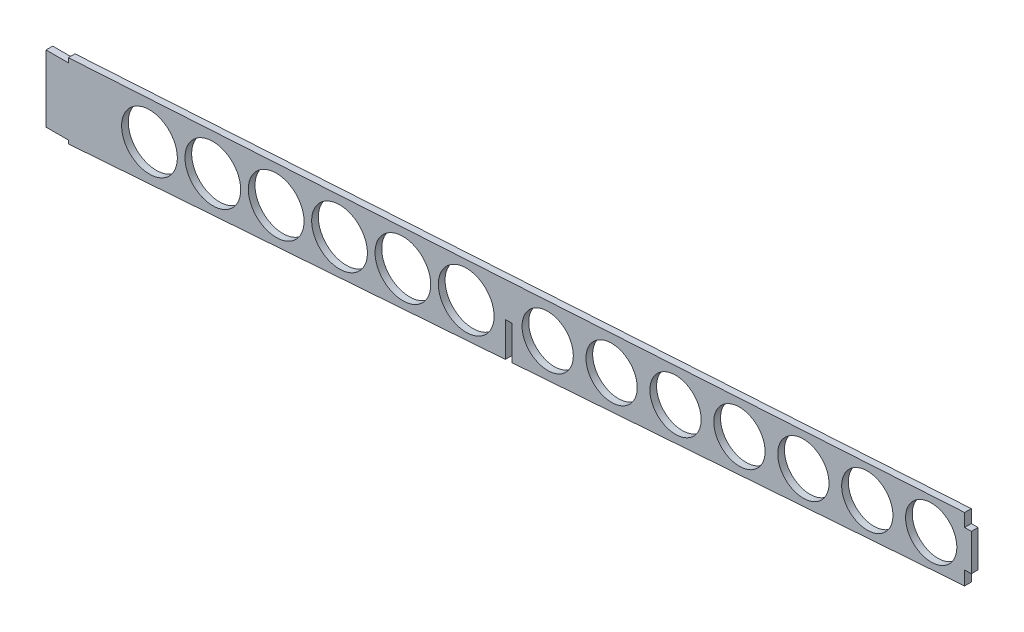
ISO-10303-21;
HEADER;
FILE_DESCRIPTION(('STEP AP214'),'2;1');
FILE_NAME('part.step','',(''),(''),'','','');
FILE_SCHEMA(('AUTOMOTIVE_DESIGN { 1 0 10303 214 1 1 1 1 }'));
ENDSEC;
DATA;
#1=APPLICATION_CONTEXT('core data for automotive mechanical design processes');
#2=APPLICATION_PROTOCOL_DEFINITION('international standard','automotive_design',2000,#1);
#3=PRODUCT_CONTEXT('',#1,'mechanical');
#4=PRODUCT('Part','Part','',(#3));
#5=PRODUCT_RELATED_PRODUCT_CATEGORY('part','',(#4));
#6=PRODUCT_DEFINITION_FORMATION('','',#4);
#7=PRODUCT_DEFINITION_CONTEXT('part definition',#1,'design');
#8=PRODUCT_DEFINITION('design','',#6,#7);
#9=PRODUCT_DEFINITION_SHAPE('','',#8);
#10=(LENGTH_UNIT() NAMED_UNIT(*) SI_UNIT(.MILLI.,.METRE.));
#11=(NAMED_UNIT(*) PLANE_ANGLE_UNIT() SI_UNIT($,.RADIAN.));
#12=(NAMED_UNIT(*) SI_UNIT($,.STERADIAN.) SOLID_ANGLE_UNIT());
#13=UNCERTAINTY_MEASURE_WITH_UNIT(LENGTH_MEASURE(1.E-05),#10,'distance_accuracy_value','');
#14=(GEOMETRIC_REPRESENTATION_CONTEXT(3) GLOBAL_UNCERTAINTY_ASSIGNED_CONTEXT((#13)) GLOBAL_UNIT_ASSIGNED_CONTEXT((#10,
#11,#12)) REPRESENTATION_CONTEXT('',''));
#15=CARTESIAN_POINT('',(0.,0.,0.));
#16=DIRECTION('',(0.,0.,1.));
#17=DIRECTION('',(1.,0.,0.));
#18=AXIS2_PLACEMENT_3D('',#15,#16,#17);
#19=CARTESIAN_POINT('',(-405.,0.,3.));
#20=DIRECTION('',(-0.0726951215049418,0.997354209551141,0.));
#21=DIRECTION('',(-0.997354209551141,-0.0726951215049418,0.));
#22=AXIS2_PLACEMENT_3D('',#19,#20,#21);
#23=PLANE('',#22);
#24=DIRECTION('',(0.997354209551141,0.0726951215049418,0.));
#25=VECTOR('',#24,1.);
#26=CARTESIAN_POINT('',(-405.,0.,0.));
#27=LINE('',#26,#25);
#28=CARTESIAN_POINT('',(-206.,14.5047055909996,0.));
#29=VERTEX_POINT('',#28);
#30=CARTESIAN_POINT('',(-3.,29.3009630531751,0.));
#31=VERTEX_POINT('',#30);
#32=EDGE_CURVE('E314',#29,#31,#27,.T.);
#33=ORIENTED_EDGE('',*,*,#32,.T.);
#34=DIRECTION('',(0.,0.,1.));
#35=VECTOR('',#34,1.);
#36=CARTESIAN_POINT('',(-3.,29.3009630531751,3.));
#37=LINE('',#36,#35);
#38=CARTESIAN_POINT('',(-3.,29.3009630531751,3.));
#39=VERTEX_POINT('',#38);
#40=EDGE_CURVE('E172',#31,#39,#37,.T.);
#41=ORIENTED_EDGE('',*,*,#40,.T.);
#42=DIRECTION('',(0.997354209551141,0.0726951215049418,0.));
#43=VECTOR('',#42,1.);
#44=CARTESIAN_POINT('',(-405.,0.,3.));
#45=LINE('',#44,#43);
#46=CARTESIAN_POINT('',(-206.,14.5047055909996,3.));
#47=VERTEX_POINT('',#46);
#48=EDGE_CURVE('E296',#47,#39,#45,.T.);
#49=ORIENTED_EDGE('',*,*,#48,.F.);
#50=DIRECTION('',(0.,0.,-1.));
#51=VECTOR('',#50,1.);
#52=CARTESIAN_POINT('',(-206.,14.5047055909996,3.));
#53=LINE('',#52,#51);
#54=EDGE_CURVE('E243',#47,#29,#53,.T.);
#55=ORIENTED_EDGE('',*,*,#54,.T.);
#56=EDGE_LOOP('',(#33,#41,#49,#55));
#57=FACE_BOUND('',#56,.T.);
#58=ADVANCED_FACE('F37',(#57),#23,.F.);
#59=CARTESIAN_POINT('',(-415.,31.5,3.));
#60=DIRECTION('',(0.,-1.,0.));
#61=DIRECTION('',(0.,0.,-1.));
#62=AXIS2_PLACEMENT_3D('',#59,#60,#61);
#63=PLANE('',#62);
#64=DIRECTION('',(-1.,0.,0.));
#65=VECTOR('',#64,1.);
#66=CARTESIAN_POINT('',(-415.,31.5,0.));
#67=LINE('',#66,#65);
#68=CARTESIAN_POINT('',(-405.,31.5,0.));
#69=VERTEX_POINT('',#68);
#70=CARTESIAN_POINT('',(-415.,31.5,0.));
#71=VERTEX_POINT('',#70);
#72=EDGE_CURVE('E285',#69,#71,#67,.T.);
#73=ORIENTED_EDGE('',*,*,#72,.T.);
#74=DIRECTION('',(0.,0.,-1.));
#75=VECTOR('',#74,1.);
#76=CARTESIAN_POINT('',(-415.,31.5,3.));
#77=LINE('',#76,#75);
#78=CARTESIAN_POINT('',(-415.,31.5,3.));
#79=VERTEX_POINT('',#78);
#80=EDGE_CURVE('E338',#79,#71,#77,.T.);
#81=ORIENTED_EDGE('',*,*,#80,.F.);
#82=DIRECTION('',(-1.,0.,0.));
#83=VECTOR('',#82,1.);
#84=CARTESIAN_POINT('',(-415.,31.5,3.));
#85=LINE('',#84,#83);
#86=CARTESIAN_POINT('',(-405.,31.5,3.));
#87=VERTEX_POINT('',#86);
#88=EDGE_CURVE('E286',#87,#79,#85,.T.);
#89=ORIENTED_EDGE('',*,*,#88,.F.);
#90=DIRECTION('',(0.,0.,-1.));
#91=VECTOR('',#90,1.);
#92=CARTESIAN_POINT('',(-405.,31.5,3.));
#93=LINE('',#92,#91);
#94=EDGE_CURVE('E305',#87,#69,#93,.T.);
#95=ORIENTED_EDGE('',*,*,#94,.T.);
#96=EDGE_LOOP('',(#73,#81,#89,#95));
#97=FACE_BOUND('',#96,.T.);
#98=ADVANCED_FACE('F39',(#97),#63,.F.);
#99=CARTESIAN_POINT('',(-415.,1.5,3.));
#100=DIRECTION('',(1.,0.,0.));
#101=DIRECTION('',(0.,0.,-1.));
#102=AXIS2_PLACEMENT_3D('',#99,#100,#101);
#103=PLANE('',#102);
#104=DIRECTION('',(0.,-1.,0.));
#105=VECTOR('',#104,1.);
#106=CARTESIAN_POINT('',(-415.,1.5,0.));
#107=LINE('',#106,#105);
#108=CARTESIAN_POINT('',(-415.,1.5,0.));
#109=VERTEX_POINT('',#108);
#110=EDGE_CURVE('E308',#71,#109,#107,.T.);
#111=ORIENTED_EDGE('',*,*,#110,.T.);
#112=DIRECTION('',(0.,0.,-1.));
#113=VECTOR('',#112,1.);
#114=CARTESIAN_POINT('',(-415.,1.5,3.));
#115=LINE('',#114,#113);
#116=CARTESIAN_POINT('',(-415.,1.5,3.));
#117=VERTEX_POINT('',#116);
#118=EDGE_CURVE('E335',#117,#109,#115,.T.);
#119=ORIENTED_EDGE('',*,*,#118,.F.);
#120=DIRECTION('',(0.,-1.,0.));
#121=VECTOR('',#120,1.);
#122=CARTESIAN_POINT('',(-415.,1.5,3.));
#123=LINE('',#122,#121);
#124=EDGE_CURVE('E289',#79,#117,#123,.T.);
#125=ORIENTED_EDGE('',*,*,#124,.F.);
#126=ORIENTED_EDGE('',*,*,#80,.T.);
#127=EDGE_LOOP('',(#111,#119,#125,#126));
#128=FACE_BOUND('',#127,.T.);
#129=ADVANCED_FACE('F366',(#128),#103,.F.);
#130=CARTESIAN_POINT('',(-415.,1.5,3.));
#131=DIRECTION('',(0.,1.,0.));
#132=DIRECTION('',(0.,0.,1.));
#133=AXIS2_PLACEMENT_3D('',#130,#131,#132);
#134=PLANE('',#133);
#135=DIRECTION('',(1.,0.,0.));
#136=VECTOR('',#135,1.);
#137=CARTESIAN_POINT('',(-415.,1.5,0.));
#138=LINE('',#137,#136);
#139=CARTESIAN_POINT('',(-405.,1.5,0.));
#140=VERTEX_POINT('',#139);
#141=EDGE_CURVE('E310',#109,#140,#138,.T.);
#142=ORIENTED_EDGE('',*,*,#141,.T.);
#143=DIRECTION('',(0.,0.,-1.));
#144=VECTOR('',#143,1.);
#145=CARTESIAN_POINT('',(-405.,1.5,3.));
#146=LINE('',#145,#144);
#147=CARTESIAN_POINT('',(-405.,1.5,3.));
#148=VERTEX_POINT('',#147);
#149=EDGE_CURVE('E332',#148,#140,#146,.T.);
#150=ORIENTED_EDGE('',*,*,#149,.F.);
#151=DIRECTION('',(1.,0.,0.));
#152=VECTOR('',#151,1.);
#153=CARTESIAN_POINT('',(-415.,1.5,3.));
#154=LINE('',#153,#152);
#155=EDGE_CURVE('E292',#117,#148,#154,.T.);
#156=ORIENTED_EDGE('',*,*,#155,.F.);
#157=ORIENTED_EDGE('',*,*,#118,.T.);
#158=EDGE_LOOP('',(#142,#150,#156,#157));
#159=FACE_BOUND('',#158,.T.);
#160=ADVANCED_FACE('F373',(#159),#134,.F.);
#161=CARTESIAN_POINT('',(-405.,1.5,3.));
#162=DIRECTION('',(1.,0.,0.));
#163=DIRECTION('',(0.,0.,-1.));
#164=AXIS2_PLACEMENT_3D('',#161,#162,#163);
#165=PLANE('',#164);
#166=DIRECTION('',(0.,-1.,0.));
#167=VECTOR('',#166,1.);
#168=CARTESIAN_POINT('',(-405.,1.5,0.));
#169=LINE('',#168,#167);
#170=CARTESIAN_POINT('',(-405.,0.,0.));
#171=VERTEX_POINT('',#170);
#172=EDGE_CURVE('E312',#140,#171,#169,.T.);
#173=ORIENTED_EDGE('',*,*,#172,.T.);
#174=DIRECTION('',(0.,0.,-1.));
#175=VECTOR('',#174,1.);
#176=CARTESIAN_POINT('',(-405.,0.,3.));
#177=LINE('',#176,#175);
#178=CARTESIAN_POINT('',(-405.,0.,3.));
#179=VERTEX_POINT('',#178);
#180=EDGE_CURVE('E329',#179,#171,#177,.T.);
#181=ORIENTED_EDGE('',*,*,#180,.F.);
#182=DIRECTION('',(0.,-1.,0.));
#183=VECTOR('',#182,1.);
#184=CARTESIAN_POINT('',(-405.,1.5,3.));
#185=LINE('',#184,#183);
#186=EDGE_CURVE('E294',#148,#179,#185,.T.);
#187=ORIENTED_EDGE('',*,*,#186,.F.);
#188=ORIENTED_EDGE('',*,*,#149,.T.);
#189=EDGE_LOOP('',(#173,#181,#187,#188));
#190=FACE_BOUND('',#189,.T.);
#191=ADVANCED_FACE('F377',(#190),#165,.F.);
#192=CARTESIAN_POINT('',(-209.,14.2860416876177,0.));
#193=VERTEX_POINT('',#192);
#194=EDGE_CURVE('E315',#171,#193,#27,.T.);
#195=ORIENTED_EDGE('',*,*,#194,.T.);
#196=DIRECTION('',(0.,0.,1.));
#197=VECTOR('',#196,1.);
#198=CARTESIAN_POINT('',(-209.,14.2860416876177,0.));
#199=LINE('',#198,#197);
#200=CARTESIAN_POINT('',(-209.,14.2860416876177,3.));
#201=VERTEX_POINT('',#200);
#202=EDGE_CURVE('E229',#193,#201,#199,.T.);
#203=ORIENTED_EDGE('',*,*,#202,.T.);
#204=EDGE_CURVE('E297',#179,#201,#45,.T.);
#205=ORIENTED_EDGE('',*,*,#204,.F.);
#206=ORIENTED_EDGE('',*,*,#180,.T.);
#207=EDGE_LOOP('',(#195,#203,#205,#206));
#208=FACE_BOUND('',#207,.T.);
#209=ADVANCED_FACE('F381',(#208),#23,.F.);
#210=CARTESIAN_POINT('',(0.,58.019626956557,3.));
#211=DIRECTION('',(-1.,0.,0.));
#212=DIRECTION('',(0.,-1.,0.));
#213=AXIS2_PLACEMENT_3D('',#210,#211,#212);
#214=PLANE('',#213);
#215=DIRECTION('',(0.,1.,0.));
#216=VECTOR('',#215,1.);
#217=CARTESIAN_POINT('',(0.,58.019626956557,0.));
#218=LINE('',#217,#216);
#219=CARTESIAN_POINT('',(0.,35.519626956557,0.));
#220=VERTEX_POINT('',#219);
#221=CARTESIAN_POINT('',(0.,52.019626956557,0.));
#222=VERTEX_POINT('',#221);
#223=EDGE_CURVE('E318',#220,#222,#218,.T.);
#224=ORIENTED_EDGE('',*,*,#223,.T.);
#225=DIRECTION('',(0.,0.,1.));
#226=VECTOR('',#225,1.);
#227=CARTESIAN_POINT('',(0.,52.019626956557,-7.));
#228=LINE('',#227,#226);
#229=CARTESIAN_POINT('',(0.,52.019626956557,3.));
#230=VERTEX_POINT('',#229);
#231=EDGE_CURVE('E153',#222,#230,#228,.T.);
#232=ORIENTED_EDGE('',*,*,#231,.T.);
#233=DIRECTION('',(0.,1.,0.));
#234=VECTOR('',#233,1.);
#235=CARTESIAN_POINT('',(0.,58.019626956557,3.));
#236=LINE('',#235,#234);
#237=CARTESIAN_POINT('',(0.,35.519626956557,3.));
#238=VERTEX_POINT('',#237);
#239=EDGE_CURVE('E169',#238,#230,#236,.T.);
#240=ORIENTED_EDGE('',*,*,#239,.F.);
#241=DIRECTION('',(0.,0.,1.));
#242=VECTOR('',#241,1.);
#243=CARTESIAN_POINT('',(0.,35.519626956557,-7.));
#244=LINE('',#243,#242);
#245=EDGE_CURVE('E174',#220,#238,#244,.T.);
#246=ORIENTED_EDGE('',*,*,#245,.F.);
#247=EDGE_LOOP('',(#224,#232,#240,#246));
#248=FACE_BOUND('',#247,.T.);
#249=ADVANCED_FACE('F404',(#248),#214,.F.);
#250=CARTESIAN_POINT('',(-405.,33.5,3.));
#251=DIRECTION('',(0.0604316379648142,-0.99817233839297,0.));
#252=DIRECTION('',(0.99817233839297,0.0604316379648142,0.));
#253=AXIS2_PLACEMENT_3D('',#250,#251,#252);
#254=PLANE('',#253);
#255=DIRECTION('',(-0.99817233839297,-0.0604316379648142,0.));
#256=VECTOR('',#255,1.);
#257=CARTESIAN_POINT('',(-405.,33.5,3.));
#258=LINE('',#257,#256);
#259=CARTESIAN_POINT('',(-3.,57.8380000902121,3.));
#260=VERTEX_POINT('',#259);
#261=CARTESIAN_POINT('',(-405.,33.5,3.));
#262=VERTEX_POINT('',#261);
#263=EDGE_CURVE('E301',#260,#262,#258,.T.);
#264=ORIENTED_EDGE('',*,*,#263,.F.);
#265=DIRECTION('',(0.,0.,-1.));
#266=VECTOR('',#265,1.);
#267=CARTESIAN_POINT('',(-3.,57.8380000902121,3.));
#268=LINE('',#267,#266);
#269=CARTESIAN_POINT('',(-3.00000000000003,57.8380000902121,0.));
#270=VERTEX_POINT('',#269);
#271=EDGE_CURVE('E159',#260,#270,#268,.T.);
#272=ORIENTED_EDGE('',*,*,#271,.T.);
#273=DIRECTION('',(-0.99817233839297,-0.0604316379648142,0.));
#274=VECTOR('',#273,1.);
#275=CARTESIAN_POINT('',(-405.,33.5,0.));
#276=LINE('',#275,#274);
#277=CARTESIAN_POINT('',(-405.,33.5,0.));
#278=VERTEX_POINT('',#277);
#279=EDGE_CURVE('E321',#270,#278,#276,.T.);
#280=ORIENTED_EDGE('',*,*,#279,.T.);
#281=DIRECTION('',(0.,0.,-1.));
#282=VECTOR('',#281,1.);
#283=CARTESIAN_POINT('',(-405.,33.5,3.));
#284=LINE('',#283,#282);
#285=EDGE_CURVE('E326',#262,#278,#284,.T.);
#286=ORIENTED_EDGE('',*,*,#285,.F.);
#287=EDGE_LOOP('',(#264,#272,#280,#286));
#288=FACE_BOUND('',#287,.T.);
#289=ADVANCED_FACE('F355',(#288),#254,.F.);
#290=CARTESIAN_POINT('',(-405.,31.5,3.));
#291=DIRECTION('',(1.,0.,0.));
#292=DIRECTION('',(0.,0.,-1.));
#293=AXIS2_PLACEMENT_3D('',#290,#291,#292);
#294=PLANE('',#293);
#295=DIRECTION('',(0.,-1.,0.));
#296=VECTOR('',#295,1.);
#297=CARTESIAN_POINT('',(-405.,31.5,0.));
#298=LINE('',#297,#296);
#299=EDGE_CURVE('E290',#278,#69,#298,.T.);
#300=ORIENTED_EDGE('',*,*,#299,.T.);
#301=ORIENTED_EDGE('',*,*,#94,.F.);
#302=DIRECTION('',(0.,-1.,0.));
#303=VECTOR('',#302,1.);
#304=CARTESIAN_POINT('',(-405.,31.5,3.));
#305=LINE('',#304,#303);
#306=EDGE_CURVE('E303',#262,#87,#305,.T.);
#307=ORIENTED_EDGE('',*,*,#306,.F.);
#308=ORIENTED_EDGE('',*,*,#285,.T.);
#309=EDGE_LOOP('',(#300,#301,#307,#308));
#310=FACE_BOUND('',#309,.T.);
#311=ADVANCED_FACE('F362',(#310),#294,.F.);
#312=CARTESIAN_POINT('',(0.,0.,3.));
#313=DIRECTION('',(0.,0.,1.));
#314=DIRECTION('',(1.,0.,0.));
#315=AXIS2_PLACEMENT_3D('',#312,#313,#314);
#316=PLANE('',#315);
#317=DIRECTION('',(1.,0.,0.));
#318=VECTOR('',#317,1.);
#319=CARTESIAN_POINT('',(0.,52.019626956557,3.));
#320=LINE('',#319,#318);
#321=CARTESIAN_POINT('',(-3.,52.019626956557,3.));
#322=VERTEX_POINT('',#321);
#323=EDGE_CURVE('E150',#322,#230,#320,.T.);
#324=ORIENTED_EDGE('',*,*,#323,.F.);
#325=DIRECTION('',(0.,-1.,0.));
#326=VECTOR('',#325,1.);
#327=CARTESIAN_POINT('',(-3.,58.019626956557,3.));
#328=LINE('',#327,#326);
#329=EDGE_CURVE('E156',#260,#322,#328,.T.);
#330=ORIENTED_EDGE('',*,*,#329,.F.);
#331=ORIENTED_EDGE('',*,*,#263,.T.);
#332=ORIENTED_EDGE('',*,*,#306,.T.);
#333=ORIENTED_EDGE('',*,*,#88,.T.);
#334=ORIENTED_EDGE('',*,*,#124,.T.);
#335=ORIENTED_EDGE('',*,*,#155,.T.);
#336=ORIENTED_EDGE('',*,*,#186,.T.);
#337=ORIENTED_EDGE('',*,*,#204,.T.);
#338=DIRECTION('',(0.,-1.,0.));
#339=VECTOR('',#338,1.);
#340=CARTESIAN_POINT('',(-209.,0.,3.));
#341=LINE('',#340,#339);
#342=CARTESIAN_POINT('',(-209.,29.805119766676,3.));
#343=VERTEX_POINT('',#342);
#344=EDGE_CURVE('E239',#343,#201,#341,.T.);
#345=ORIENTED_EDGE('',*,*,#344,.F.);
#346=DIRECTION('',(-1.,0.,0.));
#347=VECTOR('',#346,1.);
#348=CARTESIAN_POINT('',(0.,29.805119766676,3.));
#349=LINE('',#348,#347);
#350=CARTESIAN_POINT('',(-206.,29.805119766676,3.));
#351=VERTEX_POINT('',#350);
#352=EDGE_CURVE('E232',#351,#343,#349,.T.);
#353=ORIENTED_EDGE('',*,*,#352,.F.);
#354=DIRECTION('',(0.,1.,0.));
#355=VECTOR('',#354,1.);
#356=CARTESIAN_POINT('',(-206.,0.,3.));
#357=LINE('',#356,#355);
#358=EDGE_CURVE('E241',#47,#351,#357,.T.);
#359=ORIENTED_EDGE('',*,*,#358,.F.);
#360=ORIENTED_EDGE('',*,*,#48,.T.);
#361=DIRECTION('',(0.,-1.,0.));
#362=VECTOR('',#361,1.);
#363=CARTESIAN_POINT('',(-3.,28.1899742356754,3.));
#364=LINE('',#363,#362);
#365=CARTESIAN_POINT('',(-3.,35.519626956557,3.));
#366=VERTEX_POINT('',#365);
#367=EDGE_CURVE('E176',#366,#39,#364,.T.);
#368=ORIENTED_EDGE('',*,*,#367,.F.);
#369=DIRECTION('',(-1.,0.,0.));
#370=VECTOR('',#369,1.);
#371=CARTESIAN_POINT('',(0.,35.519626956557,3.));
#372=LINE('',#371,#370);
#373=EDGE_CURVE('E162',#238,#366,#372,.T.);
#374=ORIENTED_EDGE('',*,*,#373,.F.);
#375=ORIENTED_EDGE('',*,*,#239,.T.);
#376=EDGE_LOOP('',(#324,#330,#331,#332,#333,#334,#335,#336,#337,#345,#353,#359,#360,#368,#374,#375));
#377=FACE_BOUND('',#376,.T.);
#378=CARTESIAN_POINT('',(-17.9875508342229,42.5721366447861,3.));
#379=DIRECTION('',(0.,0.,1.));
#380=DIRECTION('',(1.,0.,0.));
#381=AXIS2_PLACEMENT_3D('',#378,#379,#380);
#382=CIRCLE('',#381,11.5);
#383=CARTESIAN_POINT('',(-6.4875508342229,42.5721366447861,3.));
#384=VERTEX_POINT('',#383);
#385=EDGE_CURVE('E282',#384,#384,#382,.T.);
#386=ORIENTED_EDGE('',*,*,#385,.F.);
#387=EDGE_LOOP('',(#386));
#388=FACE_BOUND('',#387,.T.);
#389=CARTESIAN_POINT('',(-46.6562923618524,40.6407896089128,3.));
#390=DIRECTION('',(0.,0.,1.));
#391=DIRECTION('',(1.,0.,0.));
#392=AXIS2_PLACEMENT_3D('',#389,#390,#391);
#393=CIRCLE('',#392,11.5);
#394=CARTESIAN_POINT('',(-35.1562923618524,40.6407896089128,3.));
#395=VERTEX_POINT('',#394);
#396=EDGE_CURVE('E279',#395,#395,#393,.T.);
#397=ORIENTED_EDGE('',*,*,#396,.F.);
#398=EDGE_LOOP('',(#397));
#399=FACE_BOUND('',#398,.T.);
#400=CARTESIAN_POINT('',(-75.3250338894819,38.7094425730394,3.));
#401=DIRECTION('',(0.,0.,1.));
#402=DIRECTION('',(1.,0.,0.));
#403=AXIS2_PLACEMENT_3D('',#400,#401,#402);
#404=CIRCLE('',#403,11.5);
#405=CARTESIAN_POINT('',(-63.8250338894819,38.7094425730394,3.));
#406=VERTEX_POINT('',#405);
#407=EDGE_CURVE('E276',#406,#406,#404,.T.);
#408=ORIENTED_EDGE('',*,*,#407,.F.);
#409=EDGE_LOOP('',(#408));
#410=FACE_BOUND('',#409,.T.);
#411=CARTESIAN_POINT('',(-103.993775417111,36.778095537166,3.));
#412=DIRECTION('',(0.,0.,1.));
#413=DIRECTION('',(1.,0.,0.));
#414=AXIS2_PLACEMENT_3D('',#411,#412,#413);
#415=CIRCLE('',#414,11.5);
#416=CARTESIAN_POINT('',(-92.4937754171115,36.778095537166,3.));
#417=VERTEX_POINT('',#416);
#418=EDGE_CURVE('E273',#417,#417,#415,.T.);
#419=ORIENTED_EDGE('',*,*,#418,.F.);
#420=EDGE_LOOP('',(#419));
#421=FACE_BOUND('',#420,.T.);
#422=CARTESIAN_POINT('',(-132.662516944741,34.8467485012927,3.));
#423=DIRECTION('',(0.,0.,1.));
#424=DIRECTION('',(1.,0.,0.));
#425=AXIS2_PLACEMENT_3D('',#422,#423,#424);
#426=CIRCLE('',#425,11.5);
#427=CARTESIAN_POINT('',(-121.162516944741,34.8467485012927,3.));
#428=VERTEX_POINT('',#427);
#429=EDGE_CURVE('E270',#428,#428,#426,.T.);
#430=ORIENTED_EDGE('',*,*,#429,.F.);
#431=EDGE_LOOP('',(#430));
#432=FACE_BOUND('',#431,.T.);
#433=CARTESIAN_POINT('',(-161.33125847237,32.9154014654193,3.));
#434=DIRECTION('',(0.,0.,1.));
#435=DIRECTION('',(1.,0.,0.));
#436=AXIS2_PLACEMENT_3D('',#433,#434,#435);
#437=CIRCLE('',#436,11.5);
#438=CARTESIAN_POINT('',(-149.83125847237,32.9154014654193,3.));
#439=VERTEX_POINT('',#438);
#440=EDGE_CURVE('E267',#439,#439,#437,.T.);
#441=ORIENTED_EDGE('',*,*,#440,.F.);
#442=EDGE_LOOP('',(#441));
#443=FACE_BOUND('',#442,.T.);
#444=CARTESIAN_POINT('',(-190.,30.984054429546,3.));
#445=DIRECTION('',(0.,0.,1.));
#446=DIRECTION('',(1.,0.,0.));
#447=AXIS2_PLACEMENT_3D('',#444,#445,#446);
#448=CIRCLE('',#447,11.5);
#449=CARTESIAN_POINT('',(-178.5,30.984054429546,3.));
#450=VERTEX_POINT('',#449);
#451=EDGE_CURVE('E264',#450,#450,#448,.T.);
#452=ORIENTED_EDGE('',*,*,#451,.F.);
#453=EDGE_LOOP('',(#452));
#454=FACE_BOUND('',#453,.T.);
#455=CARTESIAN_POINT('',(-226.526791626511,28.5233286711503,3.));
#456=DIRECTION('',(0.,0.,1.));
#457=DIRECTION('',(1.,0.,0.));
#458=AXIS2_PLACEMENT_3D('',#455,#456,#457);
#459=CIRCLE('',#458,12.5);
#460=CARTESIAN_POINT('',(-214.026791626511,28.5233286711503,3.));
#461=VERTEX_POINT('',#460);
#462=EDGE_CURVE('E261',#461,#461,#459,.T.);
#463=ORIENTED_EDGE('',*,*,#462,.F.);
#464=EDGE_LOOP('',(#463));
#465=FACE_BOUND('',#464,.T.);
#466=CARTESIAN_POINT('',(-254.938993022092,26.6092641526535,3.));
#467=DIRECTION('',(0.,0.,1.));
#468=DIRECTION('',(1.,0.,0.));
#469=AXIS2_PLACEMENT_3D('',#466,#467,#468);
#470=CIRCLE('',#469,12.5);
#471=CARTESIAN_POINT('',(-242.438993022092,26.6092641526535,3.));
#472=VERTEX_POINT('',#471);
#473=EDGE_CURVE('E258',#472,#472,#470,.T.);
#474=ORIENTED_EDGE('',*,*,#473,.F.);
#475=EDGE_LOOP('',(#474));
#476=FACE_BOUND('',#475,.T.);
#477=CARTESIAN_POINT('',(-283.351194417674,24.6951996341566,3.));
#478=DIRECTION('',(0.,0.,1.));
#479=DIRECTION('',(1.,0.,0.));
#480=AXIS2_PLACEMENT_3D('',#477,#478,#479);
#481=CIRCLE('',#480,12.5);
#482=CARTESIAN_POINT('',(-270.851194417674,24.6951996341566,3.));
#483=VERTEX_POINT('',#482);
#484=EDGE_CURVE('E255',#483,#483,#481,.T.);
#485=ORIENTED_EDGE('',*,*,#484,.F.);
#486=EDGE_LOOP('',(#485));
#487=FACE_BOUND('',#486,.T.);
#488=CARTESIAN_POINT('',(-311.763395813255,22.7811351156597,3.));
#489=DIRECTION('',(0.,0.,1.));
#490=DIRECTION('',(1.,0.,0.));
#491=AXIS2_PLACEMENT_3D('',#488,#489,#490);
#492=CIRCLE('',#491,12.5);
#493=CARTESIAN_POINT('',(-299.263395813255,22.7811351156597,3.));
#494=VERTEX_POINT('',#493);
#495=EDGE_CURVE('E252',#494,#494,#492,.T.);
#496=ORIENTED_EDGE('',*,*,#495,.F.);
#497=EDGE_LOOP('',(#496));
#498=FACE_BOUND('',#497,.T.);
#499=CARTESIAN_POINT('',(-340.175597208837,20.8670705971629,3.));
#500=DIRECTION('',(0.,0.,1.));
#501=DIRECTION('',(1.,0.,0.));
#502=AXIS2_PLACEMENT_3D('',#499,#500,#501);
#503=CIRCLE('',#502,12.5);
#504=CARTESIAN_POINT('',(-327.675597208837,20.8670705971629,3.));
#505=VERTEX_POINT('',#504);
#506=EDGE_CURVE('E249',#505,#505,#503,.T.);
#507=ORIENTED_EDGE('',*,*,#506,.F.);
#508=EDGE_LOOP('',(#507));
#509=FACE_BOUND('',#508,.T.);
#510=CARTESIAN_POINT('',(-368.587798604418,18.953006078666,3.));
#511=DIRECTION('',(0.,0.,1.));
#512=DIRECTION('',(1.,0.,0.));
#513=AXIS2_PLACEMENT_3D('',#510,#511,#512);
#514=CIRCLE('',#513,12.5);
#515=CARTESIAN_POINT('',(-356.087798604418,18.953006078666,3.));
#516=VERTEX_POINT('',#515);
#517=EDGE_CURVE('E246',#516,#516,#514,.T.);
#518=ORIENTED_EDGE('',*,*,#517,.F.);
#519=EDGE_LOOP('',(#518));
#520=FACE_BOUND('',#519,.T.);
#521=ADVANCED_FACE('F165',(#377,#388,#399,#410,#421,#432,#443,#454,#465,#476,#487,#498,#509,
#520),#316,.T.);
#522=CARTESIAN_POINT('',(0.,0.,0.));
#523=DIRECTION('',(0.,0.,1.));
#524=DIRECTION('',(1.,0.,0.));
#525=AXIS2_PLACEMENT_3D('',#522,#523,#524);
#526=PLANE('',#525);
#527=CARTESIAN_POINT('',(-17.9875508342229,42.5721366447861,0.));
#528=DIRECTION('',(0.,0.,1.));
#529=DIRECTION('',(1.,0.,0.));
#530=AXIS2_PLACEMENT_3D('',#527,#528,#529);
#531=CIRCLE('',#530,11.5);
#532=CARTESIAN_POINT('',(-6.4875508342229,42.5721366447861,0.));
#533=VERTEX_POINT('',#532);
#534=EDGE_CURVE('E183',#533,#533,#531,.T.);
#535=ORIENTED_EDGE('',*,*,#534,.T.);
#536=EDGE_LOOP('',(#535));
#537=FACE_BOUND('',#536,.T.);
#538=CARTESIAN_POINT('',(-46.6562923618524,40.6407896089128,0.));
#539=DIRECTION('',(0.,0.,1.));
#540=DIRECTION('',(1.,0.,0.));
#541=AXIS2_PLACEMENT_3D('',#538,#539,#540);
#542=CIRCLE('',#541,11.5);
#543=CARTESIAN_POINT('',(-35.1562923618524,40.6407896089128,0.));
#544=VERTEX_POINT('',#543);
#545=EDGE_CURVE('E218',#544,#544,#542,.T.);
#546=ORIENTED_EDGE('',*,*,#545,.T.);
#547=EDGE_LOOP('',(#546));
#548=FACE_BOUND('',#547,.T.);
#549=CARTESIAN_POINT('',(-75.3250338894819,38.7094425730394,0.));
#550=DIRECTION('',(0.,0.,1.));
#551=DIRECTION('',(1.,0.,0.));
#552=AXIS2_PLACEMENT_3D('',#549,#550,#551);
#553=CIRCLE('',#552,11.5);
#554=CARTESIAN_POINT('',(-63.8250338894819,38.7094425730394,0.));
#555=VERTEX_POINT('',#554);
#556=EDGE_CURVE('E215',#555,#555,#553,.T.);
#557=ORIENTED_EDGE('',*,*,#556,.T.);
#558=EDGE_LOOP('',(#557));
#559=FACE_BOUND('',#558,.T.);
#560=CARTESIAN_POINT('',(-103.993775417111,36.778095537166,0.));
#561=DIRECTION('',(0.,0.,1.));
#562=DIRECTION('',(1.,0.,0.));
#563=AXIS2_PLACEMENT_3D('',#560,#561,#562);
#564=CIRCLE('',#563,11.5);
#565=CARTESIAN_POINT('',(-92.4937754171115,36.778095537166,0.));
#566=VERTEX_POINT('',#565);
#567=EDGE_CURVE('E212',#566,#566,#564,.T.);
#568=ORIENTED_EDGE('',*,*,#567,.T.);
#569=EDGE_LOOP('',(#568));
#570=FACE_BOUND('',#569,.T.);
#571=CARTESIAN_POINT('',(-132.662516944741,34.8467485012927,0.));
#572=DIRECTION('',(0.,0.,1.));
#573=DIRECTION('',(1.,0.,0.));
#574=AXIS2_PLACEMENT_3D('',#571,#572,#573);
#575=CIRCLE('',#574,11.5);
#576=CARTESIAN_POINT('',(-121.162516944741,34.8467485012927,0.));
#577=VERTEX_POINT('',#576);
#578=EDGE_CURVE('E209',#577,#577,#575,.T.);
#579=ORIENTED_EDGE('',*,*,#578,.T.);
#580=EDGE_LOOP('',(#579));
#581=FACE_BOUND('',#580,.T.);
#582=CARTESIAN_POINT('',(-161.33125847237,32.9154014654193,0.));
#583=DIRECTION('',(0.,0.,1.));
#584=DIRECTION('',(1.,0.,0.));
#585=AXIS2_PLACEMENT_3D('',#582,#583,#584);
#586=CIRCLE('',#585,11.5);
#587=CARTESIAN_POINT('',(-149.83125847237,32.9154014654193,0.));
#588=VERTEX_POINT('',#587);
#589=EDGE_CURVE('E206',#588,#588,#586,.T.);
#590=ORIENTED_EDGE('',*,*,#589,.T.);
#591=EDGE_LOOP('',(#590));
#592=FACE_BOUND('',#591,.T.);
#593=CARTESIAN_POINT('',(-190.,30.984054429546,0.));
#594=DIRECTION('',(0.,0.,1.));
#595=DIRECTION('',(1.,0.,0.));
#596=AXIS2_PLACEMENT_3D('',#593,#594,#595);
#597=CIRCLE('',#596,11.5);
#598=CARTESIAN_POINT('',(-178.5,30.984054429546,0.));
#599=VERTEX_POINT('',#598);
#600=EDGE_CURVE('E203',#599,#599,#597,.T.);
#601=ORIENTED_EDGE('',*,*,#600,.T.);
#602=EDGE_LOOP('',(#601));
#603=FACE_BOUND('',#602,.T.);
#604=CARTESIAN_POINT('',(-226.526791626511,28.5233286711503,0.));
#605=DIRECTION('',(0.,0.,1.));
#606=DIRECTION('',(1.,0.,0.));
#607=AXIS2_PLACEMENT_3D('',#604,#605,#606);
#608=CIRCLE('',#607,12.5);
#609=CARTESIAN_POINT('',(-214.026791626511,28.5233286711503,0.));
#610=VERTEX_POINT('',#609);
#611=EDGE_CURVE('E200',#610,#610,#608,.T.);
#612=ORIENTED_EDGE('',*,*,#611,.T.);
#613=EDGE_LOOP('',(#612));
#614=FACE_BOUND('',#613,.T.);
#615=CARTESIAN_POINT('',(-254.938993022092,26.6092641526535,0.));
#616=DIRECTION('',(0.,0.,1.));
#617=DIRECTION('',(1.,0.,0.));
#618=AXIS2_PLACEMENT_3D('',#615,#616,#617);
#619=CIRCLE('',#618,12.5);
#620=CARTESIAN_POINT('',(-242.438993022092,26.6092641526535,0.));
#621=VERTEX_POINT('',#620);
#622=EDGE_CURVE('E197',#621,#621,#619,.T.);
#623=ORIENTED_EDGE('',*,*,#622,.T.);
#624=EDGE_LOOP('',(#623));
#625=FACE_BOUND('',#624,.T.);
#626=CARTESIAN_POINT('',(-283.351194417674,24.6951996341566,0.));
#627=DIRECTION('',(0.,0.,1.));
#628=DIRECTION('',(1.,0.,0.));
#629=AXIS2_PLACEMENT_3D('',#626,#627,#628);
#630=CIRCLE('',#629,12.5);
#631=CARTESIAN_POINT('',(-270.851194417674,24.6951996341566,0.));
#632=VERTEX_POINT('',#631);
#633=EDGE_CURVE('E194',#632,#632,#630,.T.);
#634=ORIENTED_EDGE('',*,*,#633,.T.);
#635=EDGE_LOOP('',(#634));
#636=FACE_BOUND('',#635,.T.);
#637=CARTESIAN_POINT('',(-311.763395813255,22.7811351156597,0.));
#638=DIRECTION('',(0.,0.,1.));
#639=DIRECTION('',(1.,0.,0.));
#640=AXIS2_PLACEMENT_3D('',#637,#638,#639);
#641=CIRCLE('',#640,12.5);
#642=CARTESIAN_POINT('',(-299.263395813255,22.7811351156597,0.));
#643=VERTEX_POINT('',#642);
#644=EDGE_CURVE('E191',#643,#643,#641,.T.);
#645=ORIENTED_EDGE('',*,*,#644,.T.);
#646=EDGE_LOOP('',(#645));
#647=FACE_BOUND('',#646,.T.);
#648=CARTESIAN_POINT('',(-340.175597208837,20.8670705971629,0.));
#649=DIRECTION('',(0.,0.,1.));
#650=DIRECTION('',(1.,0.,0.));
#651=AXIS2_PLACEMENT_3D('',#648,#649,#650);
#652=CIRCLE('',#651,12.5);
#653=CARTESIAN_POINT('',(-327.675597208837,20.8670705971629,0.));
#654=VERTEX_POINT('',#653);
#655=EDGE_CURVE('E188',#654,#654,#652,.T.);
#656=ORIENTED_EDGE('',*,*,#655,.T.);
#657=EDGE_LOOP('',(#656));
#658=FACE_BOUND('',#657,.T.);
#659=CARTESIAN_POINT('',(-368.587798604418,18.953006078666,0.));
#660=DIRECTION('',(0.,0.,1.));
#661=DIRECTION('',(1.,0.,0.));
#662=AXIS2_PLACEMENT_3D('',#659,#660,#661);
#663=CIRCLE('',#662,12.5);
#664=CARTESIAN_POINT('',(-356.087798604418,18.953006078666,0.));
#665=VERTEX_POINT('',#664);
#666=EDGE_CURVE('E184',#665,#665,#663,.T.);
#667=ORIENTED_EDGE('',*,*,#666,.T.);
#668=EDGE_LOOP('',(#667));
#669=FACE_BOUND('',#668,.T.);
#670=DIRECTION('',(0.,-1.,0.));
#671=VECTOR('',#670,1.);
#672=CARTESIAN_POINT('',(-2.99999999999999,0.,0.));
#673=LINE('',#672,#671);
#674=CARTESIAN_POINT('',(-3.,52.019626956557,0.));
#675=VERTEX_POINT('',#674);
#676=EDGE_CURVE('E45',#270,#675,#673,.T.);
#677=ORIENTED_EDGE('',*,*,#676,.T.);
#678=DIRECTION('',(1.,0.,0.));
#679=VECTOR('',#678,1.);
#680=CARTESIAN_POINT('',(0.,52.019626956557,0.));
#681=LINE('',#680,#679);
#682=EDGE_CURVE('E11',#675,#222,#681,.T.);
#683=ORIENTED_EDGE('',*,*,#682,.T.);
#684=ORIENTED_EDGE('',*,*,#223,.F.);
#685=DIRECTION('',(-1.,0.,0.));
#686=VECTOR('',#685,1.);
#687=CARTESIAN_POINT('',(0.,35.519626956557,0.));
#688=LINE('',#687,#686);
#689=CARTESIAN_POINT('',(-3.,35.519626956557,0.));
#690=VERTEX_POINT('',#689);
#691=EDGE_CURVE('E344',#220,#690,#688,.T.);
#692=ORIENTED_EDGE('',*,*,#691,.T.);
#693=DIRECTION('',(0.,-1.,0.));
#694=VECTOR('',#693,1.);
#695=CARTESIAN_POINT('',(-3.,0.,0.));
#696=LINE('',#695,#694);
#697=EDGE_CURVE('E347',#690,#31,#696,.T.);
#698=ORIENTED_EDGE('',*,*,#697,.T.);
#699=ORIENTED_EDGE('',*,*,#32,.F.);
#700=DIRECTION('',(0.,1.,0.));
#701=VECTOR('',#700,1.);
#702=CARTESIAN_POINT('',(-206.,0.,0.));
#703=LINE('',#702,#701);
#704=CARTESIAN_POINT('',(-206.,29.805119766676,0.));
#705=VERTEX_POINT('',#704);
#706=EDGE_CURVE('E341',#29,#705,#703,.T.);
#707=ORIENTED_EDGE('',*,*,#706,.T.);
#708=DIRECTION('',(-1.,0.,0.));
#709=VECTOR('',#708,1.);
#710=CARTESIAN_POINT('',(-209.,29.805119766676,0.));
#711=LINE('',#710,#709);
#712=CARTESIAN_POINT('',(-209.,29.805119766676,0.));
#713=VERTEX_POINT('',#712);
#714=EDGE_CURVE('E187',#705,#713,#711,.T.);
#715=ORIENTED_EDGE('',*,*,#714,.T.);
#716=DIRECTION('',(0.,-1.,0.));
#717=VECTOR('',#716,1.);
#718=CARTESIAN_POINT('',(-209.,29.805119766676,0.));
#719=LINE('',#718,#717);
#720=EDGE_CURVE('E225',#713,#193,#719,.T.);
#721=ORIENTED_EDGE('',*,*,#720,.T.);
#722=ORIENTED_EDGE('',*,*,#194,.F.);
#723=ORIENTED_EDGE('',*,*,#172,.F.);
#724=ORIENTED_EDGE('',*,*,#141,.F.);
#725=ORIENTED_EDGE('',*,*,#110,.F.);
#726=ORIENTED_EDGE('',*,*,#72,.F.);
#727=ORIENTED_EDGE('',*,*,#299,.F.);
#728=ORIENTED_EDGE('',*,*,#279,.F.);
#729=EDGE_LOOP('',(#677,#683,#684,#692,#698,#699,#707,#715,#721,#722,#723,#724,#725,#726,#727,#728));
#730=FACE_BOUND('',#729,.T.);
#731=ADVANCED_FACE('F351',(#537,#548,#559,#570,#581,#592,#603,#614,#625,#636,#647,#658,#669,
#730),#526,.F.);
#732=CARTESIAN_POINT('',(-206.,14.2860416876177,0.));
#733=DIRECTION('',(1.,0.,0.));
#734=DIRECTION('',(0.,0.,-1.));
#735=AXIS2_PLACEMENT_3D('',#732,#733,#734);
#736=PLANE('',#735);
#737=ORIENTED_EDGE('',*,*,#358,.T.);
#738=DIRECTION('',(0.,0.,1.));
#739=VECTOR('',#738,1.);
#740=CARTESIAN_POINT('',(-206.,29.805119766676,0.));
#741=LINE('',#740,#739);
#742=EDGE_CURVE('E228',#705,#351,#741,.T.);
#743=ORIENTED_EDGE('',*,*,#742,.F.);
#744=ORIENTED_EDGE('',*,*,#706,.F.);
#745=ORIENTED_EDGE('',*,*,#54,.F.);
#746=EDGE_LOOP('',(#737,#743,#744,#745));
#747=FACE_BOUND('',#746,.T.);
#748=ADVANCED_FACE('F394',(#747),#736,.F.);
#749=CARTESIAN_POINT('',(-209.,29.805119766676,0.));
#750=DIRECTION('',(-1.,0.,0.));
#751=DIRECTION('',(0.,0.,1.));
#752=AXIS2_PLACEMENT_3D('',#749,#750,#751);
#753=PLANE('',#752);
#754=ORIENTED_EDGE('',*,*,#344,.T.);
#755=ORIENTED_EDGE('',*,*,#202,.F.);
#756=ORIENTED_EDGE('',*,*,#720,.F.);
#757=DIRECTION('',(0.,0.,1.));
#758=VECTOR('',#757,1.);
#759=CARTESIAN_POINT('',(-209.,29.805119766676,0.));
#760=LINE('',#759,#758);
#761=EDGE_CURVE('E233',#713,#343,#760,.T.);
#762=ORIENTED_EDGE('',*,*,#761,.T.);
#763=EDGE_LOOP('',(#754,#755,#756,#762));
#764=FACE_BOUND('',#763,.T.);
#765=ADVANCED_FACE('F386',(#764),#753,.F.);
#766=CARTESIAN_POINT('',(-209.,29.805119766676,0.));
#767=DIRECTION('',(0.,1.,0.));
#768=DIRECTION('',(0.,0.,1.));
#769=AXIS2_PLACEMENT_3D('',#766,#767,#768);
#770=PLANE('',#769);
#771=ORIENTED_EDGE('',*,*,#352,.T.);
#772=ORIENTED_EDGE('',*,*,#761,.F.);
#773=ORIENTED_EDGE('',*,*,#714,.F.);
#774=ORIENTED_EDGE('',*,*,#742,.T.);
#775=EDGE_LOOP('',(#771,#772,#773,#774));
#776=FACE_BOUND('',#775,.T.);
#777=ADVANCED_FACE('F390',(#776),#770,.F.);
#778=CARTESIAN_POINT('',(-368.587798604418,18.953006078666,0.));
#779=DIRECTION('',(0.,0.,1.));
#780=DIRECTION('',(1.,0.,0.));
#781=AXIS2_PLACEMENT_3D('',#778,#779,#780);
#782=CYLINDRICAL_SURFACE('',#781,12.5);
#783=ORIENTED_EDGE('',*,*,#517,.T.);
#784=EDGE_LOOP('',(#783));
#785=FACE_BOUND('',#784,.T.);
#786=ORIENTED_EDGE('',*,*,#666,.F.);
#787=EDGE_LOOP('',(#786));
#788=FACE_BOUND('',#787,.T.);
#789=ADVANCED_FACE('F473',(#785,#788),#782,.F.);
#790=CARTESIAN_POINT('',(-340.175597208837,20.8670705971629,0.));
#791=DIRECTION('',(0.,0.,1.));
#792=DIRECTION('',(1.,0.,0.));
#793=AXIS2_PLACEMENT_3D('',#790,#791,#792);
#794=CYLINDRICAL_SURFACE('',#793,12.5);
#795=ORIENTED_EDGE('',*,*,#506,.T.);
#796=EDGE_LOOP('',(#795));
#797=FACE_BOUND('',#796,.T.);
#798=ORIENTED_EDGE('',*,*,#655,.F.);
#799=EDGE_LOOP('',(#798));
#800=FACE_BOUND('',#799,.T.);
#801=ADVANCED_FACE('F483',(#797,#800),#794,.F.);
#802=CARTESIAN_POINT('',(-311.763395813255,22.7811351156597,0.));
#803=DIRECTION('',(0.,0.,1.));
#804=DIRECTION('',(1.,0.,0.));
#805=AXIS2_PLACEMENT_3D('',#802,#803,#804);
#806=CYLINDRICAL_SURFACE('',#805,12.5);
#807=ORIENTED_EDGE('',*,*,#495,.T.);
#808=EDGE_LOOP('',(#807));
#809=FACE_BOUND('',#808,.T.);
#810=ORIENTED_EDGE('',*,*,#644,.F.);
#811=EDGE_LOOP('',(#810));
#812=FACE_BOUND('',#811,.T.);
#813=ADVANCED_FACE('F494',(#809,#812),#806,.F.);
#814=CARTESIAN_POINT('',(-283.351194417674,24.6951996341566,0.));
#815=DIRECTION('',(0.,0.,1.));
#816=DIRECTION('',(1.,0.,0.));
#817=AXIS2_PLACEMENT_3D('',#814,#815,#816);
#818=CYLINDRICAL_SURFACE('',#817,12.5);
#819=ORIENTED_EDGE('',*,*,#484,.T.);
#820=EDGE_LOOP('',(#819));
#821=FACE_BOUND('',#820,.T.);
#822=ORIENTED_EDGE('',*,*,#633,.F.);
#823=EDGE_LOOP('',(#822));
#824=FACE_BOUND('',#823,.T.);
#825=ADVANCED_FACE('F505',(#821,#824),#818,.F.);
#826=CARTESIAN_POINT('',(-254.938993022092,26.6092641526535,0.));
#827=DIRECTION('',(0.,0.,1.));
#828=DIRECTION('',(1.,0.,0.));
#829=AXIS2_PLACEMENT_3D('',#826,#827,#828);
#830=CYLINDRICAL_SURFACE('',#829,12.5);
#831=ORIENTED_EDGE('',*,*,#473,.T.);
#832=EDGE_LOOP('',(#831));
#833=FACE_BOUND('',#832,.T.);
#834=ORIENTED_EDGE('',*,*,#622,.F.);
#835=EDGE_LOOP('',(#834));
#836=FACE_BOUND('',#835,.T.);
#837=ADVANCED_FACE('F516',(#833,#836),#830,.F.);
#838=CARTESIAN_POINT('',(-226.526791626511,28.5233286711503,0.));
#839=DIRECTION('',(0.,0.,1.));
#840=DIRECTION('',(1.,0.,0.));
#841=AXIS2_PLACEMENT_3D('',#838,#839,#840);
#842=CYLINDRICAL_SURFACE('',#841,12.5);
#843=ORIENTED_EDGE('',*,*,#462,.T.);
#844=EDGE_LOOP('',(#843));
#845=FACE_BOUND('',#844,.T.);
#846=ORIENTED_EDGE('',*,*,#611,.F.);
#847=EDGE_LOOP('',(#846));
#848=FACE_BOUND('',#847,.T.);
#849=ADVANCED_FACE('F527',(#845,#848),#842,.F.);
#850=CARTESIAN_POINT('',(-190.,30.984054429546,0.));
#851=DIRECTION('',(0.,0.,1.));
#852=DIRECTION('',(1.,0.,0.));
#853=AXIS2_PLACEMENT_3D('',#850,#851,#852);
#854=CYLINDRICAL_SURFACE('',#853,11.5);
#855=ORIENTED_EDGE('',*,*,#451,.T.);
#856=EDGE_LOOP('',(#855));
#857=FACE_BOUND('',#856,.T.);
#858=ORIENTED_EDGE('',*,*,#600,.F.);
#859=EDGE_LOOP('',(#858));
#860=FACE_BOUND('',#859,.T.);
#861=ADVANCED_FACE('F538',(#857,#860),#854,.F.);
#862=CARTESIAN_POINT('',(-161.33125847237,32.9154014654193,0.));
#863=DIRECTION('',(0.,0.,1.));
#864=DIRECTION('',(1.,0.,0.));
#865=AXIS2_PLACEMENT_3D('',#862,#863,#864);
#866=CYLINDRICAL_SURFACE('',#865,11.5);
#867=ORIENTED_EDGE('',*,*,#440,.T.);
#868=EDGE_LOOP('',(#867));
#869=FACE_BOUND('',#868,.T.);
#870=ORIENTED_EDGE('',*,*,#589,.F.);
#871=EDGE_LOOP('',(#870));
#872=FACE_BOUND('',#871,.T.);
#873=ADVANCED_FACE('F549',(#869,#872),#866,.F.);
#874=CARTESIAN_POINT('',(-132.662516944741,34.8467485012927,0.));
#875=DIRECTION('',(0.,0.,1.));
#876=DIRECTION('',(1.,0.,0.));
#877=AXIS2_PLACEMENT_3D('',#874,#875,#876);
#878=CYLINDRICAL_SURFACE('',#877,11.5);
#879=ORIENTED_EDGE('',*,*,#429,.T.);
#880=EDGE_LOOP('',(#879));
#881=FACE_BOUND('',#880,.T.);
#882=ORIENTED_EDGE('',*,*,#578,.F.);
#883=EDGE_LOOP('',(#882));
#884=FACE_BOUND('',#883,.T.);
#885=ADVANCED_FACE('F560',(#881,#884),#878,.F.);
#886=CARTESIAN_POINT('',(-103.993775417111,36.778095537166,0.));
#887=DIRECTION('',(0.,0.,1.));
#888=DIRECTION('',(1.,0.,0.));
#889=AXIS2_PLACEMENT_3D('',#886,#887,#888);
#890=CYLINDRICAL_SURFACE('',#889,11.5);
#891=ORIENTED_EDGE('',*,*,#418,.T.);
#892=EDGE_LOOP('',(#891));
#893=FACE_BOUND('',#892,.T.);
#894=ORIENTED_EDGE('',*,*,#567,.F.);
#895=EDGE_LOOP('',(#894));
#896=FACE_BOUND('',#895,.T.);
#897=ADVANCED_FACE('F571',(#893,#896),#890,.F.);
#898=CARTESIAN_POINT('',(-75.3250338894819,38.7094425730394,0.));
#899=DIRECTION('',(0.,0.,1.));
#900=DIRECTION('',(1.,0.,0.));
#901=AXIS2_PLACEMENT_3D('',#898,#899,#900);
#902=CYLINDRICAL_SURFACE('',#901,11.5);
#903=ORIENTED_EDGE('',*,*,#407,.T.);
#904=EDGE_LOOP('',(#903));
#905=FACE_BOUND('',#904,.T.);
#906=ORIENTED_EDGE('',*,*,#556,.F.);
#907=EDGE_LOOP('',(#906));
#908=FACE_BOUND('',#907,.T.);
#909=ADVANCED_FACE('F582',(#905,#908),#902,.F.);
#910=CARTESIAN_POINT('',(-46.6562923618524,40.6407896089128,0.));
#911=DIRECTION('',(0.,0.,1.));
#912=DIRECTION('',(1.,0.,0.));
#913=AXIS2_PLACEMENT_3D('',#910,#911,#912);
#914=CYLINDRICAL_SURFACE('',#913,11.5);
#915=ORIENTED_EDGE('',*,*,#396,.T.);
#916=EDGE_LOOP('',(#915));
#917=FACE_BOUND('',#916,.T.);
#918=ORIENTED_EDGE('',*,*,#545,.F.);
#919=EDGE_LOOP('',(#918));
#920=FACE_BOUND('',#919,.T.);
#921=ADVANCED_FACE('F593',(#917,#920),#914,.F.);
#922=CARTESIAN_POINT('',(-17.9875508342229,42.5721366447861,0.));
#923=DIRECTION('',(0.,0.,1.));
#924=DIRECTION('',(1.,0.,0.));
#925=AXIS2_PLACEMENT_3D('',#922,#923,#924);
#926=CYLINDRICAL_SURFACE('',#925,11.5);
#927=ORIENTED_EDGE('',*,*,#385,.T.);
#928=EDGE_LOOP('',(#927));
#929=FACE_BOUND('',#928,.T.);
#930=ORIENTED_EDGE('',*,*,#534,.F.);
#931=EDGE_LOOP('',(#930));
#932=FACE_BOUND('',#931,.T.);
#933=ADVANCED_FACE('F604',(#929,#932),#926,.F.);
#934=CARTESIAN_POINT('',(-3.,28.1899742356754,-7.));
#935=DIRECTION('',(-1.,0.,0.));
#936=DIRECTION('',(0.,-1.,0.));
#937=AXIS2_PLACEMENT_3D('',#934,#935,#936);
#938=PLANE('',#937);
#939=ORIENTED_EDGE('',*,*,#697,.F.);
#940=DIRECTION('',(0.,0.,1.));
#941=VECTOR('',#940,1.);
#942=CARTESIAN_POINT('',(-3.,35.519626956557,-7.));
#943=LINE('',#942,#941);
#944=EDGE_CURVE('E60',#690,#366,#943,.T.);
#945=ORIENTED_EDGE('',*,*,#944,.T.);
#946=ORIENTED_EDGE('',*,*,#367,.T.);
#947=ORIENTED_EDGE('',*,*,#40,.F.);
#948=EDGE_LOOP('',(#939,#945,#946,#947));
#949=FACE_BOUND('',#948,.T.);
#950=ADVANCED_FACE('F400',(#949),#938,.F.);
#951=CARTESIAN_POINT('',(0.,35.519626956557,-7.));
#952=DIRECTION('',(0.,1.,0.));
#953=DIRECTION('',(0.,0.,1.));
#954=AXIS2_PLACEMENT_3D('',#951,#952,#953);
#955=PLANE('',#954);
#956=ORIENTED_EDGE('',*,*,#245,.T.);
#957=ORIENTED_EDGE('',*,*,#373,.T.);
#958=ORIENTED_EDGE('',*,*,#944,.F.);
#959=ORIENTED_EDGE('',*,*,#691,.F.);
#960=EDGE_LOOP('',(#956,#957,#958,#959));
#961=FACE_BOUND('',#960,.T.);
#962=ADVANCED_FACE('F401',(#961),#955,.F.);
#963=CARTESIAN_POINT('',(0.,52.019626956557,-7.));
#964=DIRECTION('',(0.,-1.,0.));
#965=DIRECTION('',(0.,0.,-1.));
#966=AXIS2_PLACEMENT_3D('',#963,#964,#965);
#967=PLANE('',#966);
#968=DIRECTION('',(0.,0.,1.));
#969=VECTOR('',#968,1.);
#970=CARTESIAN_POINT('',(-3.,52.019626956557,-7.));
#971=LINE('',#970,#969);
#972=EDGE_CURVE('E52',#675,#322,#971,.T.);
#973=ORIENTED_EDGE('',*,*,#972,.T.);
#974=ORIENTED_EDGE('',*,*,#323,.T.);
#975=ORIENTED_EDGE('',*,*,#231,.F.);
#976=ORIENTED_EDGE('',*,*,#682,.F.);
#977=EDGE_LOOP('',(#973,#974,#975,#976));
#978=FACE_BOUND('',#977,.T.);
#979=ADVANCED_FACE('F148',(#978),#967,.F.);
#980=CARTESIAN_POINT('',(-3.,58.019626956557,-7.));
#981=DIRECTION('',(-1.,0.,0.));
#982=DIRECTION('',(0.,-1.,0.));
#983=AXIS2_PLACEMENT_3D('',#980,#981,#982);
#984=PLANE('',#983);
#985=ORIENTED_EDGE('',*,*,#329,.T.);
#986=ORIENTED_EDGE('',*,*,#972,.F.);
#987=ORIENTED_EDGE('',*,*,#676,.F.);
#988=ORIENTED_EDGE('',*,*,#271,.F.);
#989=EDGE_LOOP('',(#985,#986,#987,#988));
#990=FACE_BOUND('',#989,.T.);
#991=ADVANCED_FACE('F157',(#990),#984,.F.);
#992=CLOSED_SHELL('',(#58,#98,#129,#160,#191,#209,#249,#289,#311,#521,#731,#748,#765,#777,#789,
#801,#813,#825,#837,#849,#861,#873,#885,#897,#909,#921,#933,#950,#962,#979,#991));
#993=MANIFOLD_SOLID_BREP('B2',#992);
#994=ADVANCED_BREP_SHAPE_REPRESENTATION('',(#18,#993),#14);
#995=SHAPE_DEFINITION_REPRESENTATION(#9,#994);
ENDSEC;
END-ISO-10303-21;
